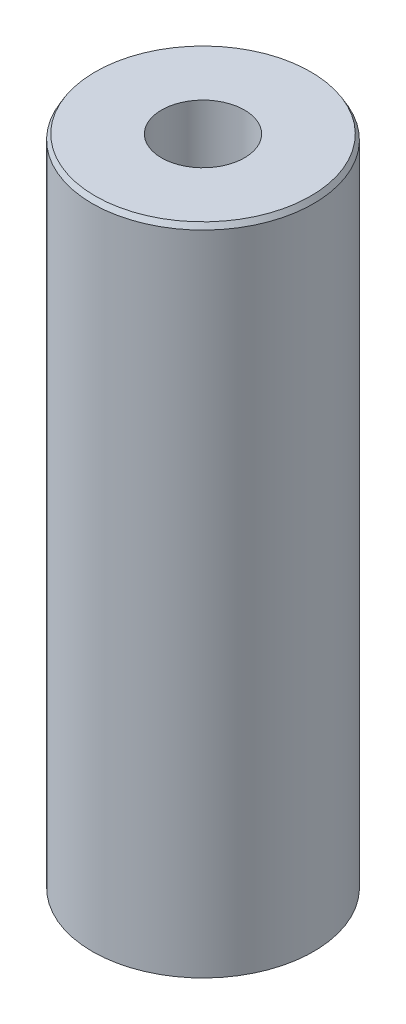
ISO-10303-21;
HEADER;
FILE_DESCRIPTION(('STEP AP214'),'2;1');
FILE_NAME('part.step','',(''),(''),'','','');
FILE_SCHEMA(('AUTOMOTIVE_DESIGN { 1 0 10303 214 1 1 1 1 }'));
ENDSEC;
DATA;
#1=APPLICATION_CONTEXT('core data for automotive mechanical design processes');
#2=APPLICATION_PROTOCOL_DEFINITION('international standard','automotive_design',2000,#1);
#3=PRODUCT_CONTEXT('',#1,'mechanical');
#4=PRODUCT('Part','Part','',(#3));
#5=PRODUCT_RELATED_PRODUCT_CATEGORY('part','',(#4));
#6=PRODUCT_DEFINITION_FORMATION('','',#4);
#7=PRODUCT_DEFINITION_CONTEXT('part definition',#1,'design');
#8=PRODUCT_DEFINITION('design','',#6,#7);
#9=PRODUCT_DEFINITION_SHAPE('','',#8);
#10=(LENGTH_UNIT() NAMED_UNIT(*) SI_UNIT(.MILLI.,.METRE.));
#11=(NAMED_UNIT(*) PLANE_ANGLE_UNIT() SI_UNIT($,.RADIAN.));
#12=(NAMED_UNIT(*) SI_UNIT($,.STERADIAN.) SOLID_ANGLE_UNIT());
#13=UNCERTAINTY_MEASURE_WITH_UNIT(LENGTH_MEASURE(1.E-05),#10,'distance_accuracy_value','');
#14=(GEOMETRIC_REPRESENTATION_CONTEXT(3) GLOBAL_UNCERTAINTY_ASSIGNED_CONTEXT((#13)) GLOBAL_UNIT_ASSIGNED_CONTEXT((#10,
#11,#12)) REPRESENTATION_CONTEXT('',''));
#15=CARTESIAN_POINT('',(0.,0.,0.));
#16=DIRECTION('',(0.,0.,1.));
#17=DIRECTION('',(1.,0.,0.));
#18=AXIS2_PLACEMENT_3D('',#15,#16,#17);
#19=CARTESIAN_POINT('',(0.,326.005846533331,0.));
#20=DIRECTION('',(0.,-1.,0.));
#21=DIRECTION('',(0.,0.,-1.));
#22=AXIS2_PLACEMENT_3D('',#19,#20,#21);
#23=CYLINDRICAL_SURFACE('',#22,55.);
#24=CARTESIAN_POINT('',(0.,323.478404204531,0.));
#25=DIRECTION('',(0.,1.,0.));
#26=DIRECTION('',(0.,0.,1.));
#27=AXIS2_PLACEMENT_3D('',#24,#25,#26);
#28=CIRCLE('',#27,55.);
#29=CARTESIAN_POINT('',(0.,323.478404204531,55.));
#30=VERTEX_POINT('',#29);
#31=EDGE_CURVE('E50',#30,#30,#28,.F.);
#32=ORIENTED_EDGE('',*,*,#31,.T.);
#33=EDGE_LOOP('',(#32));
#34=FACE_BOUND('',#33,.T.);
#35=CARTESIAN_POINT('',(0.,1.45921950889377,0.));
#36=DIRECTION('',(0.,1.,0.));
#37=DIRECTION('',(0.,0.,1.));
#38=AXIS2_PLACEMENT_3D('',#35,#36,#37);
#39=CIRCLE('',#38,55.);
#40=CARTESIAN_POINT('',(0.,1.45921950889377,55.));
#41=VERTEX_POINT('',#40);
#42=EDGE_CURVE('E51',#41,#41,#39,.T.);
#43=ORIENTED_EDGE('',*,*,#42,.T.);
#44=EDGE_LOOP('',(#43));
#45=FACE_BOUND('',#44,.T.);
#46=ADVANCED_FACE('F39',(#34,#45),#23,.T.);
#47=CARTESIAN_POINT('',(0.,326.005846533331,0.));
#48=DIRECTION('',(0.,1.,0.));
#49=DIRECTION('',(0.,0.,1.));
#50=AXIS2_PLACEMENT_3D('',#47,#48,#49);
#51=PLANE('',#50);
#52=CARTESIAN_POINT('',(0.,326.005846533331,0.));
#53=DIRECTION('',(0.,1.,0.));
#54=DIRECTION('',(0.,0.,1.));
#55=AXIS2_PLACEMENT_3D('',#52,#53,#54);
#56=CIRCLE('',#55,53.5407804911063);
#57=CARTESIAN_POINT('',(0.,326.005846533331,53.5407804911063));
#58=VERTEX_POINT('',#57);
#59=EDGE_CURVE('E54',#58,#58,#56,.T.);
#60=ORIENTED_EDGE('',*,*,#59,.T.);
#61=EDGE_LOOP('',(#60));
#62=FACE_BOUND('',#61,.T.);
#63=CARTESIAN_POINT('',(0.,326.005846533331,0.));
#64=DIRECTION('',(0.,1.,0.));
#65=DIRECTION('',(0.,0.,1.));
#66=AXIS2_PLACEMENT_3D('',#63,#64,#65);
#67=CIRCLE('',#66,20.6294899783613);
#68=CARTESIAN_POINT('',(0.,326.005846533331,20.6294899783613));
#69=VERTEX_POINT('',#68);
#70=EDGE_CURVE('E58',#69,#69,#67,.T.);
#71=ORIENTED_EDGE('',*,*,#70,.F.);
#72=EDGE_LOOP('',(#71));
#73=FACE_BOUND('',#72,.T.);
#74=ADVANCED_FACE('F69',(#62,#73),#51,.T.);
#75=CARTESIAN_POINT('',(0.,0.,0.));
#76=DIRECTION('',(0.,1.,0.));
#77=DIRECTION('',(0.,0.,1.));
#78=AXIS2_PLACEMENT_3D('',#75,#76,#77);
#79=PLANE('',#78);
#80=CARTESIAN_POINT('',(0.,0.,0.));
#81=DIRECTION('',(0.,1.,0.));
#82=DIRECTION('',(0.,0.,1.));
#83=AXIS2_PLACEMENT_3D('',#80,#81,#82);
#84=CIRCLE('',#83,52.4725576712003);
#85=CARTESIAN_POINT('',(0.,0.,52.4725576712003));
#86=VERTEX_POINT('',#85);
#87=EDGE_CURVE('E10',#86,#86,#84,.F.);
#88=ORIENTED_EDGE('',*,*,#87,.T.);
#89=EDGE_LOOP('',(#88));
#90=FACE_BOUND('',#89,.T.);
#91=CARTESIAN_POINT('',(0.,0.,0.));
#92=DIRECTION('',(0.,1.,0.));
#93=DIRECTION('',(0.,0.,1.));
#94=AXIS2_PLACEMENT_3D('',#91,#92,#93);
#95=CIRCLE('',#94,20.6294899783613);
#96=CARTESIAN_POINT('',(0.,0.,20.6294899783613));
#97=VERTEX_POINT('',#96);
#98=EDGE_CURVE('E63',#97,#97,#95,.T.);
#99=ORIENTED_EDGE('',*,*,#98,.T.);
#100=EDGE_LOOP('',(#99));
#101=FACE_BOUND('',#100,.T.);
#102=ADVANCED_FACE('F75',(#90,#101),#79,.F.);
#103=CARTESIAN_POINT('',(0.,326.005846533331,0.));
#104=DIRECTION('',(0.,-1.,0.));
#105=DIRECTION('',(0.,0.,-1.));
#106=AXIS2_PLACEMENT_3D('',#103,#104,#105);
#107=CYLINDRICAL_SURFACE('',#106,20.6294899783613);
#108=ORIENTED_EDGE('',*,*,#70,.T.);
#109=EDGE_LOOP('',(#108));
#110=FACE_BOUND('',#109,.T.);
#111=ORIENTED_EDGE('',*,*,#98,.F.);
#112=EDGE_LOOP('',(#111));
#113=FACE_BOUND('',#112,.T.);
#114=ADVANCED_FACE('F70',(#110,#113),#107,.F.);
#115=CARTESIAN_POINT('',(0.,326.005846533331,0.));
#116=DIRECTION('',(0.,-1.,0.));
#117=DIRECTION('',(0.,0.,-1.));
#118=AXIS2_PLACEMENT_3D('',#115,#116,#117);
#119=CONICAL_SURFACE('',#118,53.5407804911063,0.52359877559829);
#120=ORIENTED_EDGE('',*,*,#31,.F.);
#121=EDGE_LOOP('',(#120));
#122=FACE_BOUND('',#121,.T.);
#123=ORIENTED_EDGE('',*,*,#59,.F.);
#124=EDGE_LOOP('',(#123));
#125=FACE_BOUND('',#124,.T.);
#126=ADVANCED_FACE('F81',(#122,#125),#119,.T.);
#127=CARTESIAN_POINT('',(0.,1.45921950889377,0.));
#128=DIRECTION('',(0.,1.,0.));
#129=DIRECTION('',(0.,0.,1.));
#130=AXIS2_PLACEMENT_3D('',#127,#128,#129);
#131=CONICAL_SURFACE('',#130,55.,1.0471975511966);
#132=ORIENTED_EDGE('',*,*,#87,.F.);
#133=EDGE_LOOP('',(#132));
#134=FACE_BOUND('',#133,.T.);
#135=ORIENTED_EDGE('',*,*,#42,.F.);
#136=EDGE_LOOP('',(#135));
#137=FACE_BOUND('',#136,.T.);
#138=ADVANCED_FACE('F45',(#134,#137),#131,.T.);
#139=CLOSED_SHELL('',(#46,#74,#102,#114,#126,#138));
#140=MANIFOLD_SOLID_BREP('B2',#139);
#141=ADVANCED_BREP_SHAPE_REPRESENTATION('',(#18,#140),#14);
#142=SHAPE_DEFINITION_REPRESENTATION(#9,#141);
ENDSEC;
END-ISO-10303-21;
